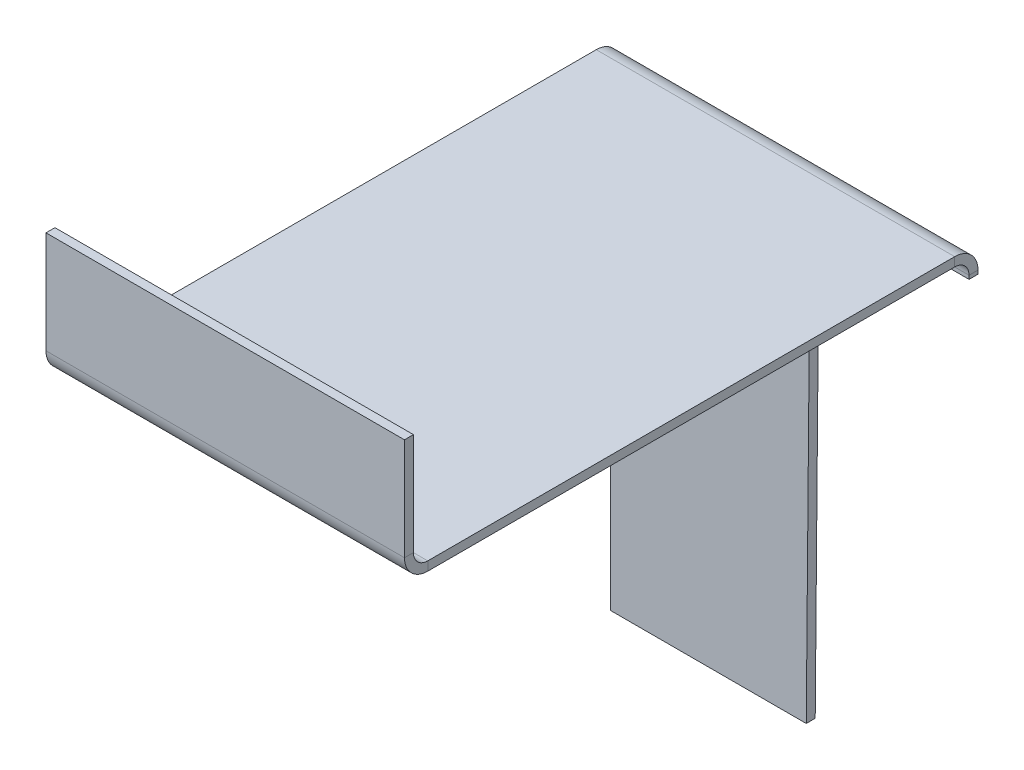
ISO-10303-21;
HEADER;
FILE_DESCRIPTION(('STEP AP214'),'2;1');
FILE_NAME('part.step','',(''),(''),'','','');
FILE_SCHEMA(('AUTOMOTIVE_DESIGN { 1 0 10303 214 1 1 1 1 }'));
ENDSEC;
DATA;
#1=APPLICATION_CONTEXT('core data for automotive mechanical design processes');
#2=APPLICATION_PROTOCOL_DEFINITION('international standard','automotive_design',2000,#1);
#3=PRODUCT_CONTEXT('',#1,'mechanical');
#4=PRODUCT('Part','Part','',(#3));
#5=PRODUCT_RELATED_PRODUCT_CATEGORY('part','',(#4));
#6=PRODUCT_DEFINITION_FORMATION('','',#4);
#7=PRODUCT_DEFINITION_CONTEXT('part definition',#1,'design');
#8=PRODUCT_DEFINITION('design','',#6,#7);
#9=PRODUCT_DEFINITION_SHAPE('','',#8);
#10=(LENGTH_UNIT() NAMED_UNIT(*) SI_UNIT(.MILLI.,.METRE.));
#11=(NAMED_UNIT(*) PLANE_ANGLE_UNIT() SI_UNIT($,.RADIAN.));
#12=(NAMED_UNIT(*) SI_UNIT($,.STERADIAN.) SOLID_ANGLE_UNIT());
#13=UNCERTAINTY_MEASURE_WITH_UNIT(LENGTH_MEASURE(1.E-05),#10,'distance_accuracy_value','');
#14=(GEOMETRIC_REPRESENTATION_CONTEXT(3) GLOBAL_UNCERTAINTY_ASSIGNED_CONTEXT((#13)) GLOBAL_UNIT_ASSIGNED_CONTEXT((#10,
#11,#12)) REPRESENTATION_CONTEXT('',''));
#15=CARTESIAN_POINT('',(0.,0.,0.));
#16=DIRECTION('',(0.,0.,1.));
#17=DIRECTION('',(1.,0.,0.));
#18=AXIS2_PLACEMENT_3D('',#15,#16,#17);
#19=CARTESIAN_POINT('',(0.,3.,0.));
#20=DIRECTION('',(-1.,0.,0.));
#21=DIRECTION('',(0.,-1.,0.));
#22=AXIS2_PLACEMENT_3D('',#19,#20,#21);
#23=PLANE('',#22);
#24=DIRECTION('',(0.,-1.,0.));
#25=VECTOR('',#24,1.);
#26=CARTESIAN_POINT('',(0.,3.0000000000002,60.4));
#27=LINE('',#26,#25);
#28=CARTESIAN_POINT('',(0.,3.0000000000002,60.4));
#29=VERTEX_POINT('',#28);
#30=CARTESIAN_POINT('',(0.,2.0000000000002,60.4));
#31=VERTEX_POINT('',#30);
#32=EDGE_CURVE('E226',#29,#31,#27,.T.);
#33=ORIENTED_EDGE('',*,*,#32,.T.);
#34=DIRECTION('',(0.,0.,1.));
#35=VECTOR('',#34,1.);
#36=CARTESIAN_POINT('',(0.,2.,0.));
#37=LINE('',#36,#35);
#38=CARTESIAN_POINT('',(0.,2.00000000000001,1.59999999999999));
#39=VERTEX_POINT('',#38);
#40=EDGE_CURVE('E251',#31,#39,#37,.F.);
#41=ORIENTED_EDGE('',*,*,#40,.T.);
#42=DIRECTION('',(0.,-1.,0.));
#43=VECTOR('',#42,1.);
#44=CARTESIAN_POINT('',(0.,3.00000000000001,1.59999999999999));
#45=LINE('',#44,#43);
#46=CARTESIAN_POINT('',(0.,3.00000000000001,1.59999999999999));
#47=VERTEX_POINT('',#46);
#48=EDGE_CURVE('E239',#39,#47,#45,.F.);
#49=ORIENTED_EDGE('',*,*,#48,.T.);
#50=DIRECTION('',(0.,0.,-1.));
#51=VECTOR('',#50,1.);
#52=CARTESIAN_POINT('',(0.,3.,0.));
#53=LINE('',#52,#51);
#54=EDGE_CURVE('E246',#29,#47,#53,.T.);
#55=ORIENTED_EDGE('',*,*,#54,.F.);
#56=EDGE_LOOP('',(#33,#41,#49,#55));
#57=FACE_BOUND('',#56,.T.);
#58=ADVANCED_FACE('F77',(#57),#23,.F.);
#59=CARTESIAN_POINT('',(-40.,3.00000000000022,63.));
#60=DIRECTION('',(1.,0.,0.));
#61=DIRECTION('',(0.,1.,0.));
#62=AXIS2_PLACEMENT_3D('',#59,#60,#61);
#63=PLANE('',#62);
#64=DIRECTION('',(0.,-1.,0.));
#65=VECTOR('',#64,1.);
#66=CARTESIAN_POINT('',(-40.,3.0000000000002,60.4));
#67=LINE('',#66,#65);
#68=CARTESIAN_POINT('',(-40.,3.0000000000002,60.4));
#69=VERTEX_POINT('',#68);
#70=CARTESIAN_POINT('',(-40.,2.00000000000021,60.4));
#71=VERTEX_POINT('',#70);
#72=EDGE_CURVE('E237',#69,#71,#67,.T.);
#73=ORIENTED_EDGE('',*,*,#72,.F.);
#74=DIRECTION('',(0.,0.,1.));
#75=VECTOR('',#74,1.);
#76=CARTESIAN_POINT('',(-40.,3.,0.));
#77=LINE('',#76,#75);
#78=CARTESIAN_POINT('',(-40.,3.,1.59999999999999));
#79=VERTEX_POINT('',#78);
#80=EDGE_CURVE('E242',#79,#69,#77,.T.);
#81=ORIENTED_EDGE('',*,*,#80,.F.);
#82=DIRECTION('',(0.,-1.,0.));
#83=VECTOR('',#82,1.);
#84=CARTESIAN_POINT('',(-40.,2.,1.6));
#85=LINE('',#84,#83);
#86=CARTESIAN_POINT('',(-40.,2.,1.6));
#87=VERTEX_POINT('',#86);
#88=EDGE_CURVE('E256',#87,#79,#85,.F.);
#89=ORIENTED_EDGE('',*,*,#88,.F.);
#90=DIRECTION('',(0.,0.,-1.));
#91=VECTOR('',#90,1.);
#92=CARTESIAN_POINT('',(-40.,2.00000000000022,63.));
#93=LINE('',#92,#91);
#94=EDGE_CURVE('E248',#87,#71,#93,.F.);
#95=ORIENTED_EDGE('',*,*,#94,.T.);
#96=EDGE_LOOP('',(#73,#81,#89,#95));
#97=FACE_BOUND('',#96,.T.);
#98=ADVANCED_FACE('F347',(#97),#63,.F.);
#99=CARTESIAN_POINT('',(0.,3.,0.));
#100=DIRECTION('',(0.,-1.,0.));
#101=DIRECTION('',(0.,0.,-1.));
#102=AXIS2_PLACEMENT_3D('',#99,#100,#101);
#103=PLANE('',#102);
#104=DIRECTION('',(1.,0.,0.));
#105=VECTOR('',#104,1.);
#106=CARTESIAN_POINT('',(0.,3.0000000000002,60.4));
#107=LINE('',#106,#105);
#108=EDGE_CURVE('E232',#29,#69,#107,.F.);
#109=ORIENTED_EDGE('',*,*,#108,.F.);
#110=ORIENTED_EDGE('',*,*,#54,.T.);
#111=DIRECTION('',(-1.,0.,0.));
#112=VECTOR('',#111,1.);
#113=CARTESIAN_POINT('',(0.,3.00000000000001,1.59999999999999));
#114=LINE('',#113,#112);
#115=EDGE_CURVE('E253',#79,#47,#114,.F.);
#116=ORIENTED_EDGE('',*,*,#115,.F.);
#117=ORIENTED_EDGE('',*,*,#80,.T.);
#118=EDGE_LOOP('',(#109,#110,#116,#117));
#119=FACE_BOUND('',#118,.T.);
#120=ADVANCED_FACE('F342',(#119),#103,.F.);
#121=CARTESIAN_POINT('',(0.,2.,0.));
#122=DIRECTION('',(0.,-1.,0.));
#123=DIRECTION('',(0.,0.,-1.));
#124=AXIS2_PLACEMENT_3D('',#121,#122,#123);
#125=PLANE('',#124);
#126=ORIENTED_EDGE('',*,*,#40,.F.);
#127=DIRECTION('',(1.,0.,0.));
#128=VECTOR('',#127,1.);
#129=CARTESIAN_POINT('',(0.,2.0000000000002,60.4));
#130=LINE('',#129,#128);
#131=EDGE_CURVE('E221',#31,#71,#130,.F.);
#132=ORIENTED_EDGE('',*,*,#131,.T.);
#133=ORIENTED_EDGE('',*,*,#94,.F.);
#134=DIRECTION('',(-1.,0.,0.));
#135=VECTOR('',#134,1.);
#136=CARTESIAN_POINT('',(0.,2.00000000000001,1.59999999999999));
#137=LINE('',#136,#135);
#138=EDGE_CURVE('E259',#39,#87,#137,.T.);
#139=ORIENTED_EDGE('',*,*,#138,.F.);
#140=EDGE_LOOP('',(#126,#132,#133,#139));
#141=FACE_BOUND('',#140,.T.);
#142=ADVANCED_FACE('F354',(#141),#125,.T.);
#143=CARTESIAN_POINT('',(-40.,3.,-1.));
#144=DIRECTION('',(-1.,0.,0.));
#145=DIRECTION('',(0.,0.,1.));
#146=AXIS2_PLACEMENT_3D('',#143,#144,#145);
#147=PLANE('',#146);
#148=DIRECTION('',(0.,-1.,0.));
#149=VECTOR('',#148,1.);
#150=CARTESIAN_POINT('',(-40.,3.,0.));
#151=LINE('',#150,#149);
#152=CARTESIAN_POINT('',(-40.,0.400000000000004,0.));
#153=VERTEX_POINT('',#152);
#154=CARTESIAN_POINT('',(-40.,-52.,0.));
#155=VERTEX_POINT('',#154);
#156=EDGE_CURVE('E303',#153,#155,#151,.T.);
#157=ORIENTED_EDGE('',*,*,#156,.F.);
#158=DIRECTION('',(0.,0.,-1.));
#159=VECTOR('',#158,1.);
#160=CARTESIAN_POINT('',(-40.,0.400000000000001,0.));
#161=LINE('',#160,#159);
#162=CARTESIAN_POINT('',(-40.,0.400000000000001,-0.999999999999997));
#163=VERTEX_POINT('',#162);
#164=EDGE_CURVE('E269',#153,#163,#161,.T.);
#165=ORIENTED_EDGE('',*,*,#164,.T.);
#166=DIRECTION('',(0.,-1.,0.));
#167=VECTOR('',#166,1.);
#168=CARTESIAN_POINT('',(-40.,3.,-1.));
#169=LINE('',#168,#167);
#170=CARTESIAN_POINT('',(-40.,-52.,-1.));
#171=VERTEX_POINT('',#170);
#172=EDGE_CURVE('E291',#163,#171,#169,.T.);
#173=ORIENTED_EDGE('',*,*,#172,.T.);
#174=DIRECTION('',(0.,0.,1.));
#175=VECTOR('',#174,1.);
#176=CARTESIAN_POINT('',(-40.,-52.,-1.));
#177=LINE('',#176,#175);
#178=EDGE_CURVE('E310',#171,#155,#177,.T.);
#179=ORIENTED_EDGE('',*,*,#178,.T.);
#180=EDGE_LOOP('',(#157,#165,#173,#179));
#181=FACE_BOUND('',#180,.T.);
#182=ADVANCED_FACE('F368',(#181),#147,.T.);
#183=CARTESIAN_POINT('',(0.,0.,-1.));
#184=DIRECTION('',(0.,0.,1.));
#185=DIRECTION('',(1.,0.,0.));
#186=AXIS2_PLACEMENT_3D('',#183,#184,#185);
#187=PLANE('',#186);
#188=DIRECTION('',(-1.,0.,0.));
#189=VECTOR('',#188,1.);
#190=CARTESIAN_POINT('',(-40.,0.400000000000001,-0.999999999999997));
#191=LINE('',#190,#189);
#192=CARTESIAN_POINT('',(0.,0.400000000000013,-1.));
#193=VERTEX_POINT('',#192);
#194=EDGE_CURVE('E263',#163,#193,#191,.F.);
#195=ORIENTED_EDGE('',*,*,#194,.T.);
#196=DIRECTION('',(0.,1.,0.));
#197=VECTOR('',#196,1.);
#198=CARTESIAN_POINT('',(0.,0.,-1.));
#199=LINE('',#198,#197);
#200=CARTESIAN_POINT('',(0.,0.,-1.));
#201=VERTEX_POINT('',#200);
#202=EDGE_CURVE('E287',#201,#193,#199,.T.);
#203=ORIENTED_EDGE('',*,*,#202,.F.);
#204=DIRECTION('',(1.,0.,0.));
#205=VECTOR('',#204,1.);
#206=CARTESIAN_POINT('',(0.,0.,-1.));
#207=LINE('',#206,#205);
#208=CARTESIAN_POINT('',(-17.7,0.,-1.));
#209=VERTEX_POINT('',#208);
#210=EDGE_CURVE('E284',#209,#201,#207,.T.);
#211=ORIENTED_EDGE('',*,*,#210,.F.);
#212=DIRECTION('',(0.00894416971596197,0.999960000114051,0.));
#213=VECTOR('',#212,1.);
#214=CARTESIAN_POINT('',(-17.7,0.,-1.));
#215=LINE('',#214,#213);
#216=CARTESIAN_POINT('',(-18.1651154297942,-52.,-1.));
#217=VERTEX_POINT('',#216);
#218=EDGE_CURVE('E296',#217,#209,#215,.T.);
#219=ORIENTED_EDGE('',*,*,#218,.F.);
#220=DIRECTION('',(1.,0.,0.));
#221=VECTOR('',#220,1.);
#222=CARTESIAN_POINT('',(-40.,-52.,-1.));
#223=LINE('',#222,#221);
#224=EDGE_CURVE('E293',#171,#217,#223,.T.);
#225=ORIENTED_EDGE('',*,*,#224,.F.);
#226=ORIENTED_EDGE('',*,*,#172,.F.);
#227=EDGE_LOOP('',(#195,#203,#211,#219,#225,#226));
#228=FACE_BOUND('',#227,.T.);
#229=ADVANCED_FACE('F328',(#228),#187,.F.);
#230=CARTESIAN_POINT('',(0.,0.,0.));
#231=DIRECTION('',(0.,0.,1.));
#232=DIRECTION('',(1.,0.,0.));
#233=AXIS2_PLACEMENT_3D('',#230,#231,#232);
#234=PLANE('',#233);
#235=DIRECTION('',(0.,1.,0.));
#236=VECTOR('',#235,1.);
#237=CARTESIAN_POINT('',(0.,0.,0.));
#238=LINE('',#237,#236);
#239=CARTESIAN_POINT('',(0.,0.,0.));
#240=VERTEX_POINT('',#239);
#241=CARTESIAN_POINT('',(0.,0.400000000000006,0.));
#242=VERTEX_POINT('',#241);
#243=EDGE_CURVE('E301',#240,#242,#238,.T.);
#244=ORIENTED_EDGE('',*,*,#243,.T.);
#245=DIRECTION('',(-1.,0.,0.));
#246=VECTOR('',#245,1.);
#247=CARTESIAN_POINT('',(-40.,0.400000000000001,0.));
#248=LINE('',#247,#246);
#249=EDGE_CURVE('E102',#153,#242,#248,.F.);
#250=ORIENTED_EDGE('',*,*,#249,.F.);
#251=ORIENTED_EDGE('',*,*,#156,.T.);
#252=DIRECTION('',(1.,0.,0.));
#253=VECTOR('',#252,1.);
#254=CARTESIAN_POINT('',(-40.,-52.,0.));
#255=LINE('',#254,#253);
#256=CARTESIAN_POINT('',(-18.1651154297942,-52.,0.));
#257=VERTEX_POINT('',#256);
#258=EDGE_CURVE('E305',#155,#257,#255,.T.);
#259=ORIENTED_EDGE('',*,*,#258,.T.);
#260=DIRECTION('',(0.00894416971596197,0.999960000114051,0.));
#261=VECTOR('',#260,1.);
#262=CARTESIAN_POINT('',(-17.7,0.,0.));
#263=LINE('',#262,#261);
#264=CARTESIAN_POINT('',(-17.7,0.,0.));
#265=VERTEX_POINT('',#264);
#266=EDGE_CURVE('E288',#257,#265,#263,.T.);
#267=ORIENTED_EDGE('',*,*,#266,.T.);
#268=DIRECTION('',(1.,0.,0.));
#269=VECTOR('',#268,1.);
#270=CARTESIAN_POINT('',(0.,0.,0.));
#271=LINE('',#270,#269);
#272=EDGE_CURVE('E281',#265,#240,#271,.T.);
#273=ORIENTED_EDGE('',*,*,#272,.T.);
#274=EDGE_LOOP('',(#244,#250,#251,#259,#267,#273));
#275=FACE_BOUND('',#274,.T.);
#276=ADVANCED_FACE('F322',(#275),#234,.T.);
#277=CARTESIAN_POINT('',(0.,0.,-1.));
#278=DIRECTION('',(0.,-1.,0.));
#279=DIRECTION('',(1.,0.,0.));
#280=AXIS2_PLACEMENT_3D('',#277,#278,#279);
#281=PLANE('',#280);
#282=ORIENTED_EDGE('',*,*,#272,.F.);
#283=DIRECTION('',(0.,0.,1.));
#284=VECTOR('',#283,1.);
#285=CARTESIAN_POINT('',(-17.7,0.,-1.));
#286=LINE('',#285,#284);
#287=EDGE_CURVE('E13',#209,#265,#286,.T.);
#288=ORIENTED_EDGE('',*,*,#287,.F.);
#289=ORIENTED_EDGE('',*,*,#210,.T.);
#290=DIRECTION('',(0.,0.,1.));
#291=VECTOR('',#290,1.);
#292=CARTESIAN_POINT('',(0.,0.,-1.));
#293=LINE('',#292,#291);
#294=EDGE_CURVE('E81',#201,#240,#293,.T.);
#295=ORIENTED_EDGE('',*,*,#294,.T.);
#296=EDGE_LOOP('',(#282,#288,#289,#295));
#297=FACE_BOUND('',#296,.T.);
#298=ADVANCED_FACE('F79',(#297),#281,.T.);
#299=CARTESIAN_POINT('',(-17.7,0.,-1.));
#300=DIRECTION('',(0.999960000114051,-0.00894416971596197,0.));
#301=DIRECTION('',(0.00894416971596197,0.999960000114051,0.));
#302=AXIS2_PLACEMENT_3D('',#299,#300,#301);
#303=PLANE('',#302);
#304=ORIENTED_EDGE('',*,*,#266,.F.);
#305=DIRECTION('',(0.,0.,1.));
#306=VECTOR('',#305,1.);
#307=CARTESIAN_POINT('',(-18.1651154297942,-52.,-1.));
#308=LINE('',#307,#306);
#309=EDGE_CURVE('E86',#217,#257,#308,.T.);
#310=ORIENTED_EDGE('',*,*,#309,.F.);
#311=ORIENTED_EDGE('',*,*,#218,.T.);
#312=ORIENTED_EDGE('',*,*,#287,.T.);
#313=EDGE_LOOP('',(#304,#310,#311,#312));
#314=FACE_BOUND('',#313,.T.);
#315=ADVANCED_FACE('F325',(#314),#303,.T.);
#316=CARTESIAN_POINT('',(-40.,-52.,-1.));
#317=DIRECTION('',(0.,-1.,0.));
#318=DIRECTION('',(0.,0.,-1.));
#319=AXIS2_PLACEMENT_3D('',#316,#317,#318);
#320=PLANE('',#319);
#321=ORIENTED_EDGE('',*,*,#258,.F.);
#322=ORIENTED_EDGE('',*,*,#178,.F.);
#323=ORIENTED_EDGE('',*,*,#224,.T.);
#324=ORIENTED_EDGE('',*,*,#309,.T.);
#325=EDGE_LOOP('',(#321,#322,#323,#324));
#326=FACE_BOUND('',#325,.T.);
#327=ADVANCED_FACE('F370',(#326),#320,.T.);
#328=CARTESIAN_POINT('',(0.,0.,-1.));
#329=DIRECTION('',(1.,0.,0.));
#330=DIRECTION('',(0.,0.,-1.));
#331=AXIS2_PLACEMENT_3D('',#328,#329,#330);
#332=PLANE('',#331);
#333=DIRECTION('',(0.,0.,-1.));
#334=VECTOR('',#333,1.);
#335=CARTESIAN_POINT('',(0.,0.400000000000006,0.));
#336=LINE('',#335,#334);
#337=EDGE_CURVE('E278',#242,#193,#336,.T.);
#338=ORIENTED_EDGE('',*,*,#337,.F.);
#339=ORIENTED_EDGE('',*,*,#243,.F.);
#340=ORIENTED_EDGE('',*,*,#294,.F.);
#341=ORIENTED_EDGE('',*,*,#202,.T.);
#342=EDGE_LOOP('',(#338,#339,#340,#341));
#343=FACE_BOUND('',#342,.T.);
#344=ADVANCED_FACE('F321',(#343),#332,.T.);
#345=CARTESIAN_POINT('',(0.,0.400000000000006,1.6));
#346=DIRECTION('',(1.,0.,0.));
#347=DIRECTION('',(0.,1.,0.));
#348=AXIS2_PLACEMENT_3D('',#345,#346,#347);
#349=PLANE('',#348);
#350=ORIENTED_EDGE('',*,*,#48,.F.);
#351=CARTESIAN_POINT('',(0.,0.400000000000006,1.6));
#352=DIRECTION('',(-1.,0.,0.));
#353=DIRECTION('',(0.,-1.,0.));
#354=AXIS2_PLACEMENT_3D('',#351,#352,#353);
#355=CIRCLE('',#354,1.6);
#356=EDGE_CURVE('E272',#242,#39,#355,.F.);
#357=ORIENTED_EDGE('',*,*,#356,.F.);
#358=ORIENTED_EDGE('',*,*,#337,.T.);
#359=CARTESIAN_POINT('',(0.,0.400000000000006,1.6));
#360=DIRECTION('',(-1.,0.,0.));
#361=DIRECTION('',(0.,-1.,0.));
#362=AXIS2_PLACEMENT_3D('',#359,#360,#361);
#363=CIRCLE('',#362,2.6);
#364=EDGE_CURVE('E265',#193,#47,#363,.F.);
#365=ORIENTED_EDGE('',*,*,#364,.T.);
#366=EDGE_LOOP('',(#350,#357,#358,#365));
#367=FACE_BOUND('',#366,.T.);
#368=ADVANCED_FACE('F335',(#367),#349,.T.);
#369=CARTESIAN_POINT('',(-40.,0.400000000000001,1.6));
#370=DIRECTION('',(1.,0.,0.));
#371=DIRECTION('',(0.,1.,0.));
#372=AXIS2_PLACEMENT_3D('',#369,#370,#371);
#373=PLANE('',#372);
#374=CARTESIAN_POINT('',(-40.,0.400000000000001,1.6));
#375=DIRECTION('',(-1.,0.,0.));
#376=DIRECTION('',(0.,-1.,0.));
#377=AXIS2_PLACEMENT_3D('',#374,#375,#376);
#378=CIRCLE('',#377,1.6);
#379=EDGE_CURVE('E245',#87,#153,#378,.T.);
#380=ORIENTED_EDGE('',*,*,#379,.F.);
#381=ORIENTED_EDGE('',*,*,#88,.T.);
#382=CARTESIAN_POINT('',(-40.,0.400000000000001,1.6));
#383=DIRECTION('',(-1.,0.,0.));
#384=DIRECTION('',(0.,-1.,0.));
#385=AXIS2_PLACEMENT_3D('',#382,#383,#384);
#386=CIRCLE('',#385,2.6);
#387=EDGE_CURVE('E266',#79,#163,#386,.T.);
#388=ORIENTED_EDGE('',*,*,#387,.T.);
#389=ORIENTED_EDGE('',*,*,#164,.F.);
#390=EDGE_LOOP('',(#380,#381,#388,#389));
#391=FACE_BOUND('',#390,.T.);
#392=ADVANCED_FACE('F367',(#391),#373,.F.);
#393=CARTESIAN_POINT('',(-40.,0.400000000000001,1.6));
#394=DIRECTION('',(-1.,0.,0.));
#395=DIRECTION('',(0.,1.,0.));
#396=AXIS2_PLACEMENT_3D('',#393,#394,#395);
#397=CYLINDRICAL_SURFACE('',#396,2.6);
#398=ORIENTED_EDGE('',*,*,#194,.F.);
#399=ORIENTED_EDGE('',*,*,#387,.F.);
#400=ORIENTED_EDGE('',*,*,#115,.T.);
#401=ORIENTED_EDGE('',*,*,#364,.F.);
#402=EDGE_LOOP('',(#398,#399,#400,#401));
#403=FACE_BOUND('',#402,.T.);
#404=ADVANCED_FACE('F337',(#403),#397,.T.);
#405=CARTESIAN_POINT('',(-40.,0.400000000000001,1.6));
#406=DIRECTION('',(-1.,0.,0.));
#407=DIRECTION('',(0.,1.,0.));
#408=AXIS2_PLACEMENT_3D('',#405,#406,#407);
#409=CYLINDRICAL_SURFACE('',#408,1.6);
#410=ORIENTED_EDGE('',*,*,#249,.T.);
#411=ORIENTED_EDGE('',*,*,#356,.T.);
#412=ORIENTED_EDGE('',*,*,#138,.T.);
#413=ORIENTED_EDGE('',*,*,#379,.T.);
#414=EDGE_LOOP('',(#410,#411,#412,#413));
#415=FACE_BOUND('',#414,.T.);
#416=ADVANCED_FACE('F363',(#415),#409,.F.);
#417=CARTESIAN_POINT('',(-40.,4.6000000000002,60.4));
#418=DIRECTION('',(-1.,0.,0.));
#419=DIRECTION('',(0.,0.,1.));
#420=AXIS2_PLACEMENT_3D('',#417,#418,#419);
#421=PLANE('',#420);
#422=DIRECTION('',(0.,0.,-1.));
#423=VECTOR('',#422,1.);
#424=CARTESIAN_POINT('',(-40.,4.6000000000002,63.));
#425=LINE('',#424,#423);
#426=CARTESIAN_POINT('',(-40.,4.6000000000002,62.));
#427=VERTEX_POINT('',#426);
#428=CARTESIAN_POINT('',(-40.,4.6000000000002,63.));
#429=VERTEX_POINT('',#428);
#430=EDGE_CURVE('E204',#427,#429,#425,.F.);
#431=ORIENTED_EDGE('',*,*,#430,.F.);
#432=CARTESIAN_POINT('',(-40.,4.6000000000002,60.4));
#433=DIRECTION('',(1.,0.,0.));
#434=DIRECTION('',(0.,0.,-1.));
#435=AXIS2_PLACEMENT_3D('',#432,#433,#434);
#436=CIRCLE('',#435,1.6);
#437=EDGE_CURVE('E229',#69,#427,#436,.F.);
#438=ORIENTED_EDGE('',*,*,#437,.F.);
#439=ORIENTED_EDGE('',*,*,#72,.T.);
#440=CARTESIAN_POINT('',(-40.,4.6000000000002,60.4));
#441=DIRECTION('',(1.,0.,0.));
#442=DIRECTION('',(0.,0.,-1.));
#443=AXIS2_PLACEMENT_3D('',#440,#441,#442);
#444=CIRCLE('',#443,2.6);
#445=EDGE_CURVE('E94',#71,#429,#444,.F.);
#446=ORIENTED_EDGE('',*,*,#445,.T.);
#447=EDGE_LOOP('',(#431,#438,#439,#446));
#448=FACE_BOUND('',#447,.T.);
#449=ADVANCED_FACE('F351',(#448),#421,.T.);
#450=CARTESIAN_POINT('',(0.,4.6000000000002,60.4));
#451=DIRECTION('',(-1.,0.,0.));
#452=DIRECTION('',(0.,0.,1.));
#453=AXIS2_PLACEMENT_3D('',#450,#451,#452);
#454=PLANE('',#453);
#455=CARTESIAN_POINT('',(0.,4.6000000000002,60.4));
#456=DIRECTION('',(1.,0.,0.));
#457=DIRECTION('',(0.,0.,-1.));
#458=AXIS2_PLACEMENT_3D('',#455,#456,#457);
#459=CIRCLE('',#458,1.6);
#460=CARTESIAN_POINT('',(0.,4.6000000000002,62.));
#461=VERTEX_POINT('',#460);
#462=EDGE_CURVE('E234',#461,#29,#459,.T.);
#463=ORIENTED_EDGE('',*,*,#462,.F.);
#464=DIRECTION('',(0.,0.,-1.));
#465=VECTOR('',#464,1.);
#466=CARTESIAN_POINT('',(0.,4.6000000000002,62.));
#467=LINE('',#466,#465);
#468=CARTESIAN_POINT('',(0.,4.6000000000002,63.));
#469=VERTEX_POINT('',#468);
#470=EDGE_CURVE('E215',#461,#469,#467,.F.);
#471=ORIENTED_EDGE('',*,*,#470,.T.);
#472=CARTESIAN_POINT('',(0.,4.6000000000002,60.4));
#473=DIRECTION('',(1.,0.,0.));
#474=DIRECTION('',(0.,0.,-1.));
#475=AXIS2_PLACEMENT_3D('',#472,#473,#474);
#476=CIRCLE('',#475,2.6);
#477=EDGE_CURVE('E224',#469,#31,#476,.T.);
#478=ORIENTED_EDGE('',*,*,#477,.T.);
#479=ORIENTED_EDGE('',*,*,#32,.F.);
#480=EDGE_LOOP('',(#463,#471,#478,#479));
#481=FACE_BOUND('',#480,.T.);
#482=ADVANCED_FACE('F359',(#481),#454,.F.);
#483=CARTESIAN_POINT('',(0.,4.6000000000002,60.4));
#484=DIRECTION('',(1.,0.,0.));
#485=DIRECTION('',(0.,0.,1.));
#486=AXIS2_PLACEMENT_3D('',#483,#484,#485);
#487=CYLINDRICAL_SURFACE('',#486,2.6);
#488=ORIENTED_EDGE('',*,*,#131,.F.);
#489=ORIENTED_EDGE('',*,*,#477,.F.);
#490=DIRECTION('',(1.,0.,0.));
#491=VECTOR('',#490,1.);
#492=CARTESIAN_POINT('',(-40.,4.6000000000002,63.));
#493=LINE('',#492,#491);
#494=EDGE_CURVE('E213',#469,#429,#493,.F.);
#495=ORIENTED_EDGE('',*,*,#494,.T.);
#496=ORIENTED_EDGE('',*,*,#445,.F.);
#497=EDGE_LOOP('',(#488,#489,#495,#496));
#498=FACE_BOUND('',#497,.T.);
#499=ADVANCED_FACE('F356',(#498),#487,.T.);
#500=CARTESIAN_POINT('',(0.,4.6000000000002,60.4));
#501=DIRECTION('',(1.,0.,0.));
#502=DIRECTION('',(0.,0.,1.));
#503=AXIS2_PLACEMENT_3D('',#500,#501,#502);
#504=CYLINDRICAL_SURFACE('',#503,1.6);
#505=ORIENTED_EDGE('',*,*,#108,.T.);
#506=ORIENTED_EDGE('',*,*,#437,.T.);
#507=DIRECTION('',(1.,0.,0.));
#508=VECTOR('',#507,1.);
#509=CARTESIAN_POINT('',(-40.,4.6000000000002,62.));
#510=LINE('',#509,#508);
#511=EDGE_CURVE('E218',#427,#461,#510,.T.);
#512=ORIENTED_EDGE('',*,*,#511,.T.);
#513=ORIENTED_EDGE('',*,*,#462,.T.);
#514=EDGE_LOOP('',(#505,#506,#512,#513));
#515=FACE_BOUND('',#514,.T.);
#516=ADVANCED_FACE('F517',(#515),#504,.F.);
#517=CARTESIAN_POINT('',(-40.,3.00000000000021,63.));
#518=DIRECTION('',(1.,0.,0.));
#519=DIRECTION('',(0.,0.,-1.));
#520=AXIS2_PLACEMENT_3D('',#517,#518,#519);
#521=PLANE('',#520);
#522=ORIENTED_EDGE('',*,*,#430,.T.);
#523=DIRECTION('',(0.,-1.,0.));
#524=VECTOR('',#523,1.);
#525=CARTESIAN_POINT('',(-40.,0.,63.));
#526=LINE('',#525,#524);
#527=CARTESIAN_POINT('',(-40.,16.0000000000002,63.));
#528=VERTEX_POINT('',#527);
#529=EDGE_CURVE('E185',#528,#429,#526,.T.);
#530=ORIENTED_EDGE('',*,*,#529,.F.);
#531=DIRECTION('',(0.,0.,-1.));
#532=VECTOR('',#531,1.);
#533=CARTESIAN_POINT('',(-40.,16.0000000000002,63.));
#534=LINE('',#533,#532);
#535=CARTESIAN_POINT('',(-40.,16.0000000000002,62.));
#536=VERTEX_POINT('',#535);
#537=EDGE_CURVE('E191',#528,#536,#534,.T.);
#538=ORIENTED_EDGE('',*,*,#537,.T.);
#539=DIRECTION('',(0.,1.,0.));
#540=VECTOR('',#539,1.);
#541=CARTESIAN_POINT('',(-40.,3.00000000000021,62.));
#542=LINE('',#541,#540);
#543=EDGE_CURVE('E211',#536,#427,#542,.F.);
#544=ORIENTED_EDGE('',*,*,#543,.T.);
#545=EDGE_LOOP('',(#522,#530,#538,#544));
#546=FACE_BOUND('',#545,.T.);
#547=ADVANCED_FACE('F203',(#546),#521,.F.);
#548=CARTESIAN_POINT('',(0.,16.0000000000002,63.));
#549=DIRECTION('',(-1.,0.,0.));
#550=DIRECTION('',(0.,-1.,0.));
#551=AXIS2_PLACEMENT_3D('',#548,#549,#550);
#552=PLANE('',#551);
#553=ORIENTED_EDGE('',*,*,#470,.F.);
#554=DIRECTION('',(0.,-1.,0.));
#555=VECTOR('',#554,1.);
#556=CARTESIAN_POINT('',(0.,16.0000000000002,62.));
#557=LINE('',#556,#555);
#558=CARTESIAN_POINT('',(0.,16.0000000000002,62.));
#559=VERTEX_POINT('',#558);
#560=EDGE_CURVE('E207',#461,#559,#557,.F.);
#561=ORIENTED_EDGE('',*,*,#560,.T.);
#562=DIRECTION('',(0.,0.,-1.));
#563=VECTOR('',#562,1.);
#564=CARTESIAN_POINT('',(0.,16.0000000000002,63.));
#565=LINE('',#564,#563);
#566=CARTESIAN_POINT('',(0.,16.0000000000002,63.));
#567=VERTEX_POINT('',#566);
#568=EDGE_CURVE('E200',#567,#559,#565,.T.);
#569=ORIENTED_EDGE('',*,*,#568,.F.);
#570=DIRECTION('',(0.,1.,0.));
#571=VECTOR('',#570,1.);
#572=CARTESIAN_POINT('',(0.,0.,63.));
#573=LINE('',#572,#571);
#574=EDGE_CURVE('E187',#469,#567,#573,.T.);
#575=ORIENTED_EDGE('',*,*,#574,.F.);
#576=EDGE_LOOP('',(#553,#561,#569,#575));
#577=FACE_BOUND('',#576,.T.);
#578=ADVANCED_FACE('F537',(#577),#552,.F.);
#579=CARTESIAN_POINT('',(0.,0.,63.));
#580=DIRECTION('',(0.,0.,-1.));
#581=DIRECTION('',(-1.,0.,0.));
#582=AXIS2_PLACEMENT_3D('',#579,#580,#581);
#583=PLANE('',#582);
#584=ORIENTED_EDGE('',*,*,#494,.F.);
#585=ORIENTED_EDGE('',*,*,#574,.T.);
#586=DIRECTION('',(-1.,0.,0.));
#587=VECTOR('',#586,1.);
#588=CARTESIAN_POINT('',(0.,16.0000000000002,63.));
#589=LINE('',#588,#587);
#590=EDGE_CURVE('E180',#567,#528,#589,.T.);
#591=ORIENTED_EDGE('',*,*,#590,.T.);
#592=ORIENTED_EDGE('',*,*,#529,.T.);
#593=EDGE_LOOP('',(#584,#585,#591,#592));
#594=FACE_BOUND('',#593,.T.);
#595=ADVANCED_FACE('F183',(#594),#583,.F.);
#596=CARTESIAN_POINT('',(0.,0.,62.));
#597=DIRECTION('',(0.,0.,-1.));
#598=DIRECTION('',(-1.,0.,0.));
#599=AXIS2_PLACEMENT_3D('',#596,#597,#598);
#600=PLANE('',#599);
#601=ORIENTED_EDGE('',*,*,#560,.F.);
#602=ORIENTED_EDGE('',*,*,#511,.F.);
#603=ORIENTED_EDGE('',*,*,#543,.F.);
#604=DIRECTION('',(1.,0.,0.));
#605=VECTOR('',#604,1.);
#606=CARTESIAN_POINT('',(-40.,16.0000000000002,62.));
#607=LINE('',#606,#605);
#608=EDGE_CURVE('E196',#559,#536,#607,.F.);
#609=ORIENTED_EDGE('',*,*,#608,.F.);
#610=EDGE_LOOP('',(#601,#602,#603,#609));
#611=FACE_BOUND('',#610,.T.);
#612=ADVANCED_FACE('F557',(#611),#600,.T.);
#613=CARTESIAN_POINT('',(-40.,16.0000000000002,63.));
#614=DIRECTION('',(0.,-1.,0.));
#615=DIRECTION('',(0.,0.,-1.));
#616=AXIS2_PLACEMENT_3D('',#613,#614,#615);
#617=PLANE('',#616);
#618=ORIENTED_EDGE('',*,*,#608,.T.);
#619=ORIENTED_EDGE('',*,*,#537,.F.);
#620=ORIENTED_EDGE('',*,*,#590,.F.);
#621=ORIENTED_EDGE('',*,*,#568,.T.);
#622=EDGE_LOOP('',(#618,#619,#620,#621));
#623=FACE_BOUND('',#622,.T.);
#624=ADVANCED_FACE('F194',(#623),#617,.F.);
#625=CLOSED_SHELL('',(#58,#98,#120,#142,#182,#229,#276,#298,#315,#327,#344,#368,#392,#404,#416,
#449,#482,#499,#516,#547,#578,#595,#612,#624));
#626=MANIFOLD_SOLID_BREP('B2',#625);
#627=ADVANCED_BREP_SHAPE_REPRESENTATION('',(#18,#626),#14);
#628=SHAPE_DEFINITION_REPRESENTATION(#9,#627);
ENDSEC;
END-ISO-10303-21;
